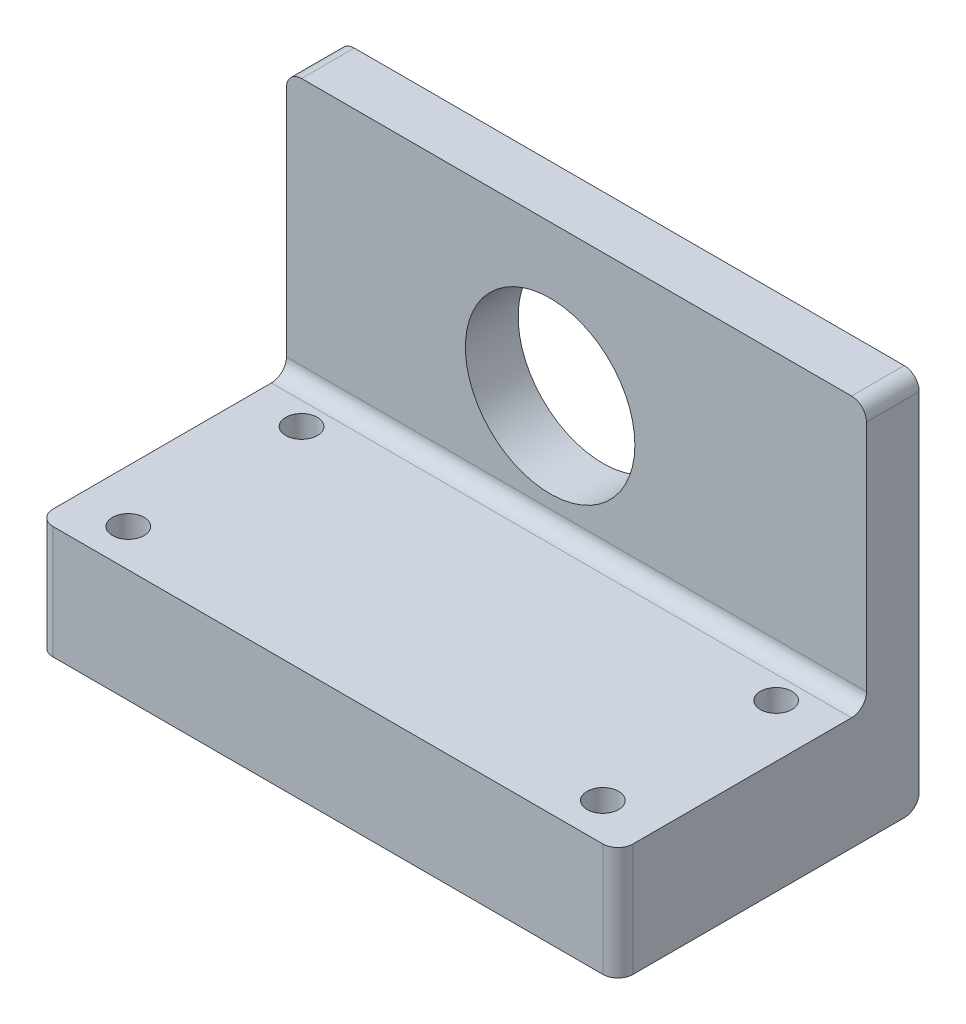
ISO-10303-21;
HEADER;
FILE_DESCRIPTION(('STEP AP214'),'2;1');
FILE_NAME('part.step','',(''),(''),'','','');
FILE_SCHEMA(('AUTOMOTIVE_DESIGN { 1 0 10303 214 1 1 1 1 }'));
ENDSEC;
DATA;
#1=APPLICATION_CONTEXT('core data for automotive mechanical design processes');
#2=APPLICATION_PROTOCOL_DEFINITION('international standard','automotive_design',2000,#1);
#3=PRODUCT_CONTEXT('',#1,'mechanical');
#4=PRODUCT('Part','Part','',(#3));
#5=PRODUCT_RELATED_PRODUCT_CATEGORY('part','',(#4));
#6=PRODUCT_DEFINITION_FORMATION('','',#4);
#7=PRODUCT_DEFINITION_CONTEXT('part definition',#1,'design');
#8=PRODUCT_DEFINITION('design','',#6,#7);
#9=PRODUCT_DEFINITION_SHAPE('','',#8);
#10=(LENGTH_UNIT() NAMED_UNIT(*) SI_UNIT(.MILLI.,.METRE.));
#11=(NAMED_UNIT(*) PLANE_ANGLE_UNIT() SI_UNIT($,.RADIAN.));
#12=(NAMED_UNIT(*) SI_UNIT($,.STERADIAN.) SOLID_ANGLE_UNIT());
#13=UNCERTAINTY_MEASURE_WITH_UNIT(LENGTH_MEASURE(1.E-05),#10,'distance_accuracy_value','');
#14=(GEOMETRIC_REPRESENTATION_CONTEXT(3) GLOBAL_UNCERTAINTY_ASSIGNED_CONTEXT((#13)) GLOBAL_UNIT_ASSIGNED_CONTEXT((#10,
#11,#12)) REPRESENTATION_CONTEXT('',''));
#15=CARTESIAN_POINT('',(0.,0.,0.));
#16=DIRECTION('',(0.,0.,1.));
#17=DIRECTION('',(1.,0.,0.));
#18=AXIS2_PLACEMENT_3D('',#15,#16,#17);
#19=CARTESIAN_POINT('',(-35.,17.5,7.));
#20=DIRECTION('',(1.,0.,0.));
#21=DIRECTION('',(0.,1.,0.));
#22=AXIS2_PLACEMENT_3D('',#19,#20,#21);
#23=PLANE('',#22);
#24=DIRECTION('',(0.,-1.,0.));
#25=VECTOR('',#24,1.);
#26=CARTESIAN_POINT('',(-35.,17.5,0.));
#27=LINE('',#26,#25);
#28=CARTESIAN_POINT('',(-35.,15.5,0.));
#29=VERTEX_POINT('',#28);
#30=CARTESIAN_POINT('',(-35.,-30.5,0.));
#31=VERTEX_POINT('',#30);
#32=EDGE_CURVE('E204',#29,#31,#27,.T.);
#33=ORIENTED_EDGE('',*,*,#32,.T.);
#34=CARTESIAN_POINT('',(-35.,-30.5,2.));
#35=DIRECTION('',(1.,0.,0.));
#36=DIRECTION('',(0.,1.,0.));
#37=AXIS2_PLACEMENT_3D('',#34,#35,#36);
#38=CIRCLE('',#37,2.);
#39=CARTESIAN_POINT('',(-35.,-32.5,2.));
#40=VERTEX_POINT('',#39);
#41=EDGE_CURVE('E167',#31,#40,#38,.F.);
#42=ORIENTED_EDGE('',*,*,#41,.T.);
#43=DIRECTION('',(0.,0.,-1.));
#44=VECTOR('',#43,1.);
#45=CARTESIAN_POINT('',(-35.,-32.5,40.));
#46=LINE('',#45,#44);
#47=CARTESIAN_POINT('',(-35.,-32.5,38.));
#48=VERTEX_POINT('',#47);
#49=EDGE_CURVE('E241',#48,#40,#46,.T.);
#50=ORIENTED_EDGE('',*,*,#49,.F.);
#51=DIRECTION('',(0.,1.,0.));
#52=VECTOR('',#51,1.);
#53=CARTESIAN_POINT('',(-35.,17.5,38.));
#54=LINE('',#53,#52);
#55=CARTESIAN_POINT('',(-35.,-17.5,38.));
#56=VERTEX_POINT('',#55);
#57=EDGE_CURVE('E165',#48,#56,#54,.T.);
#58=ORIENTED_EDGE('',*,*,#57,.T.);
#59=DIRECTION('',(0.,0.,-1.));
#60=VECTOR('',#59,1.);
#61=CARTESIAN_POINT('',(-35.,-17.5,40.));
#62=LINE('',#61,#60);
#63=CARTESIAN_POINT('',(-35.,-17.5,9.));
#64=VERTEX_POINT('',#63);
#65=EDGE_CURVE('E138',#56,#64,#62,.T.);
#66=ORIENTED_EDGE('',*,*,#65,.T.);
#67=CARTESIAN_POINT('',(-35.,-15.5,9.));
#68=DIRECTION('',(1.,0.,0.));
#69=DIRECTION('',(0.,1.,0.));
#70=AXIS2_PLACEMENT_3D('',#67,#68,#69);
#71=CIRCLE('',#70,2.);
#72=CARTESIAN_POINT('',(-35.,-15.5,7.));
#73=VERTEX_POINT('',#72);
#74=EDGE_CURVE('E134',#64,#73,#71,.T.);
#75=ORIENTED_EDGE('',*,*,#74,.T.);
#76=DIRECTION('',(0.,-1.,0.));
#77=VECTOR('',#76,1.);
#78=CARTESIAN_POINT('',(-35.,17.5,7.));
#79=LINE('',#78,#77);
#80=CARTESIAN_POINT('',(-35.,15.5,7.));
#81=VERTEX_POINT('',#80);
#82=EDGE_CURVE('E120',#81,#73,#79,.T.);
#83=ORIENTED_EDGE('',*,*,#82,.F.);
#84=DIRECTION('',(0.,0.,-1.));
#85=VECTOR('',#84,1.);
#86=CARTESIAN_POINT('',(-35.,15.5,7.));
#87=LINE('',#86,#85);
#88=EDGE_CURVE('E163',#81,#29,#87,.T.);
#89=ORIENTED_EDGE('',*,*,#88,.T.);
#90=EDGE_LOOP('',(#33,#42,#50,#58,#66,#75,#83,#89));
#91=FACE_BOUND('',#90,.T.);
#92=ADVANCED_FACE('F32',(#91),#23,.F.);
#93=CARTESIAN_POINT('',(42.,17.5,7.));
#94=DIRECTION('',(-1.,0.,0.));
#95=DIRECTION('',(0.,-1.,0.));
#96=AXIS2_PLACEMENT_3D('',#93,#94,#95);
#97=PLANE('',#96);
#98=DIRECTION('',(0.,0.,-1.));
#99=VECTOR('',#98,1.);
#100=CARTESIAN_POINT('',(42.,-32.5,40.));
#101=LINE('',#100,#99);
#102=CARTESIAN_POINT('',(42.,-32.5,38.));
#103=VERTEX_POINT('',#102);
#104=CARTESIAN_POINT('',(42.,-32.5,2.));
#105=VERTEX_POINT('',#104);
#106=EDGE_CURVE('E233',#103,#105,#101,.T.);
#107=ORIENTED_EDGE('',*,*,#106,.T.);
#108=CARTESIAN_POINT('',(42.,-30.5,2.));
#109=DIRECTION('',(-1.,0.,0.));
#110=DIRECTION('',(0.,-1.,0.));
#111=AXIS2_PLACEMENT_3D('',#108,#109,#110);
#112=CIRCLE('',#111,2.);
#113=CARTESIAN_POINT('',(42.,-30.5,0.));
#114=VERTEX_POINT('',#113);
#115=EDGE_CURVE('E180',#105,#114,#112,.F.);
#116=ORIENTED_EDGE('',*,*,#115,.T.);
#117=DIRECTION('',(0.,1.,0.));
#118=VECTOR('',#117,1.);
#119=CARTESIAN_POINT('',(42.,17.5,0.));
#120=LINE('',#119,#118);
#121=CARTESIAN_POINT('',(42.,15.5,0.));
#122=VERTEX_POINT('',#121);
#123=EDGE_CURVE('E202',#114,#122,#120,.T.);
#124=ORIENTED_EDGE('',*,*,#123,.T.);
#125=DIRECTION('',(0.,0.,-1.));
#126=VECTOR('',#125,1.);
#127=CARTESIAN_POINT('',(42.,15.5,7.));
#128=LINE('',#127,#126);
#129=CARTESIAN_POINT('',(42.,15.5,7.));
#130=VERTEX_POINT('',#129);
#131=EDGE_CURVE('E175',#122,#130,#128,.F.);
#132=ORIENTED_EDGE('',*,*,#131,.T.);
#133=DIRECTION('',(0.,1.,0.));
#134=VECTOR('',#133,1.);
#135=CARTESIAN_POINT('',(42.,17.5,7.));
#136=LINE('',#135,#134);
#137=CARTESIAN_POINT('',(42.,-15.5,7.));
#138=VERTEX_POINT('',#137);
#139=EDGE_CURVE('E130',#138,#130,#136,.T.);
#140=ORIENTED_EDGE('',*,*,#139,.F.);
#141=CARTESIAN_POINT('',(42.,-15.5,9.));
#142=DIRECTION('',(-1.,0.,0.));
#143=DIRECTION('',(0.,-1.,0.));
#144=AXIS2_PLACEMENT_3D('',#141,#142,#143);
#145=CIRCLE('',#144,2.);
#146=CARTESIAN_POINT('',(42.,-17.5,9.));
#147=VERTEX_POINT('',#146);
#148=EDGE_CURVE('E143',#138,#147,#145,.T.);
#149=ORIENTED_EDGE('',*,*,#148,.T.);
#150=DIRECTION('',(0.,0.,-1.));
#151=VECTOR('',#150,1.);
#152=CARTESIAN_POINT('',(42.,-17.5,40.));
#153=LINE('',#152,#151);
#154=CARTESIAN_POINT('',(42.,-17.5,38.));
#155=VERTEX_POINT('',#154);
#156=EDGE_CURVE('E238',#155,#147,#153,.T.);
#157=ORIENTED_EDGE('',*,*,#156,.F.);
#158=DIRECTION('',(0.,-1.,0.));
#159=VECTOR('',#158,1.);
#160=CARTESIAN_POINT('',(42.,17.5,38.));
#161=LINE('',#160,#159);
#162=EDGE_CURVE('E177',#155,#103,#161,.T.);
#163=ORIENTED_EDGE('',*,*,#162,.T.);
#164=EDGE_LOOP('',(#107,#116,#124,#132,#140,#149,#157,#163));
#165=FACE_BOUND('',#164,.T.);
#166=ADVANCED_FACE('F257',(#165),#97,.F.);
#167=CARTESIAN_POINT('',(-35.,17.5,7.));
#168=DIRECTION('',(0.,-1.,0.));
#169=DIRECTION('',(0.,0.,-1.));
#170=AXIS2_PLACEMENT_3D('',#167,#168,#169);
#171=PLANE('',#170);
#172=DIRECTION('',(-1.,0.,0.));
#173=VECTOR('',#172,1.);
#174=CARTESIAN_POINT('',(-35.,17.5,0.));
#175=LINE('',#174,#173);
#176=CARTESIAN_POINT('',(40.,17.5,0.));
#177=VERTEX_POINT('',#176);
#178=CARTESIAN_POINT('',(-33.,17.5,0.));
#179=VERTEX_POINT('',#178);
#180=EDGE_CURVE('E131',#177,#179,#175,.T.);
#181=ORIENTED_EDGE('',*,*,#180,.T.);
#182=DIRECTION('',(0.,0.,-1.));
#183=VECTOR('',#182,1.);
#184=CARTESIAN_POINT('',(-33.,17.5,7.));
#185=LINE('',#184,#183);
#186=CARTESIAN_POINT('',(-33.,17.5,7.));
#187=VERTEX_POINT('',#186);
#188=EDGE_CURVE('E47',#179,#187,#185,.F.);
#189=ORIENTED_EDGE('',*,*,#188,.T.);
#190=DIRECTION('',(-1.,0.,0.));
#191=VECTOR('',#190,1.);
#192=CARTESIAN_POINT('',(-35.,17.5,7.));
#193=LINE('',#192,#191);
#194=CARTESIAN_POINT('',(40.,17.5,7.));
#195=VERTEX_POINT('',#194);
#196=EDGE_CURVE('E148',#195,#187,#193,.T.);
#197=ORIENTED_EDGE('',*,*,#196,.F.);
#198=DIRECTION('',(0.,0.,-1.));
#199=VECTOR('',#198,1.);
#200=CARTESIAN_POINT('',(40.,17.5,7.));
#201=LINE('',#200,#199);
#202=EDGE_CURVE('E190',#195,#177,#201,.T.);
#203=ORIENTED_EDGE('',*,*,#202,.T.);
#204=EDGE_LOOP('',(#181,#189,#197,#203));
#205=FACE_BOUND('',#204,.T.);
#206=ADVANCED_FACE('F195',(#205),#171,.F.);
#207=CARTESIAN_POINT('',(0.,0.,7.));
#208=DIRECTION('',(0.,0.,1.));
#209=DIRECTION('',(1.,0.,0.));
#210=AXIS2_PLACEMENT_3D('',#207,#208,#209);
#211=PLANE('',#210);
#212=CARTESIAN_POINT('',(0.,-2.5,7.));
#213=DIRECTION('',(0.,0.,1.));
#214=DIRECTION('',(1.,0.,0.));
#215=AXIS2_PLACEMENT_3D('',#212,#213,#214);
#216=CIRCLE('',#215,11.25);
#217=CARTESIAN_POINT('',(11.25,-2.5,7.));
#218=VERTEX_POINT('',#217);
#219=EDGE_CURVE('E211',#218,#218,#216,.T.);
#220=ORIENTED_EDGE('',*,*,#219,.F.);
#221=EDGE_LOOP('',(#220));
#222=FACE_BOUND('',#221,.T.);
#223=ORIENTED_EDGE('',*,*,#196,.T.);
#224=CARTESIAN_POINT('',(-33.,15.5,7.));
#225=DIRECTION('',(0.,0.,1.));
#226=DIRECTION('',(1.,0.,0.));
#227=AXIS2_PLACEMENT_3D('',#224,#225,#226);
#228=CIRCLE('',#227,2.);
#229=EDGE_CURVE('E11',#187,#81,#228,.T.);
#230=ORIENTED_EDGE('',*,*,#229,.T.);
#231=ORIENTED_EDGE('',*,*,#82,.T.);
#232=DIRECTION('',(1.,0.,0.));
#233=VECTOR('',#232,1.);
#234=CARTESIAN_POINT('',(42.,-15.5,7.));
#235=LINE('',#234,#233);
#236=EDGE_CURVE('E124',#73,#138,#235,.T.);
#237=ORIENTED_EDGE('',*,*,#236,.T.);
#238=ORIENTED_EDGE('',*,*,#139,.T.);
#239=CARTESIAN_POINT('',(40.,15.5,7.));
#240=DIRECTION('',(0.,0.,1.));
#241=DIRECTION('',(1.,0.,0.));
#242=AXIS2_PLACEMENT_3D('',#239,#240,#241);
#243=CIRCLE('',#242,2.);
#244=EDGE_CURVE('E40',#130,#195,#243,.T.);
#245=ORIENTED_EDGE('',*,*,#244,.T.);
#246=EDGE_LOOP('',(#223,#230,#231,#237,#238,#245));
#247=FACE_BOUND('',#246,.T.);
#248=ADVANCED_FACE('F122',(#222,#247),#211,.T.);
#249=CARTESIAN_POINT('',(0.,0.,0.));
#250=DIRECTION('',(0.,0.,1.));
#251=DIRECTION('',(1.,0.,0.));
#252=AXIS2_PLACEMENT_3D('',#249,#250,#251);
#253=PLANE('',#252);
#254=CARTESIAN_POINT('',(0.,-2.5,0.));
#255=DIRECTION('',(0.,0.,1.));
#256=DIRECTION('',(1.,0.,0.));
#257=AXIS2_PLACEMENT_3D('',#254,#255,#256);
#258=CIRCLE('',#257,11.25);
#259=CARTESIAN_POINT('',(11.25,-2.5,0.));
#260=VERTEX_POINT('',#259);
#261=EDGE_CURVE('E208',#260,#260,#258,.T.);
#262=ORIENTED_EDGE('',*,*,#261,.T.);
#263=EDGE_LOOP('',(#262));
#264=FACE_BOUND('',#263,.T.);
#265=ORIENTED_EDGE('',*,*,#123,.F.);
#266=DIRECTION('',(-1.,0.,0.));
#267=VECTOR('',#266,1.);
#268=CARTESIAN_POINT('',(-35.,-30.5,0.));
#269=LINE('',#268,#267);
#270=EDGE_CURVE('E160',#114,#31,#269,.T.);
#271=ORIENTED_EDGE('',*,*,#270,.T.);
#272=ORIENTED_EDGE('',*,*,#32,.F.);
#273=CARTESIAN_POINT('',(-33.,15.5,0.));
#274=DIRECTION('',(0.,0.,1.));
#275=DIRECTION('',(1.,0.,0.));
#276=AXIS2_PLACEMENT_3D('',#273,#274,#275);
#277=CIRCLE('',#276,2.);
#278=EDGE_CURVE('E158',#29,#179,#277,.F.);
#279=ORIENTED_EDGE('',*,*,#278,.T.);
#280=ORIENTED_EDGE('',*,*,#180,.F.);
#281=CARTESIAN_POINT('',(40.,15.5,0.));
#282=DIRECTION('',(0.,0.,1.));
#283=DIRECTION('',(1.,0.,0.));
#284=AXIS2_PLACEMENT_3D('',#281,#282,#283);
#285=CIRCLE('',#284,2.);
#286=EDGE_CURVE('E142',#177,#122,#285,.F.);
#287=ORIENTED_EDGE('',*,*,#286,.T.);
#288=EDGE_LOOP('',(#265,#271,#272,#279,#280,#287));
#289=FACE_BOUND('',#288,.T.);
#290=ADVANCED_FACE('F199',(#264,#289),#253,.F.);
#291=CARTESIAN_POINT('',(0.,-2.5,-8.));
#292=DIRECTION('',(0.,0.,1.));
#293=DIRECTION('',(1.,0.,0.));
#294=AXIS2_PLACEMENT_3D('',#291,#292,#293);
#295=CYLINDRICAL_SURFACE('',#294,11.25);
#296=ORIENTED_EDGE('',*,*,#219,.T.);
#297=EDGE_LOOP('',(#296));
#298=FACE_BOUND('',#297,.T.);
#299=ORIENTED_EDGE('',*,*,#261,.F.);
#300=EDGE_LOOP('',(#299));
#301=FACE_BOUND('',#300,.T.);
#302=ADVANCED_FACE('F383',(#298,#301),#295,.F.);
#303=CARTESIAN_POINT('',(42.,-17.5,40.));
#304=DIRECTION('',(0.,1.,0.));
#305=DIRECTION('',(0.,0.,1.));
#306=AXIS2_PLACEMENT_3D('',#303,#304,#305);
#307=PLANE('',#306);
#308=CARTESIAN_POINT('',(-28.,-17.5,12.));
#309=DIRECTION('',(0.,1.,0.));
#310=DIRECTION('',(-1.,0.,0.));
#311=AXIS2_PLACEMENT_3D('',#308,#309,#310);
#312=CIRCLE('',#311,2.1);
#313=CARTESIAN_POINT('',(-30.1,-17.5,12.));
#314=VERTEX_POINT('',#313);
#315=EDGE_CURVE('E447',#314,#314,#312,.T.);
#316=ORIENTED_EDGE('',*,*,#315,.F.);
#317=EDGE_LOOP('',(#316));
#318=FACE_BOUND('',#317,.T.);
#319=CARTESIAN_POINT('',(35.,-17.5,35.));
#320=DIRECTION('',(0.,1.,0.));
#321=DIRECTION('',(-1.,0.,0.));
#322=AXIS2_PLACEMENT_3D('',#319,#320,#321);
#323=CIRCLE('',#322,2.1);
#324=CARTESIAN_POINT('',(32.9,-17.5,35.));
#325=VERTEX_POINT('',#324);
#326=EDGE_CURVE('E451',#325,#325,#323,.T.);
#327=ORIENTED_EDGE('',*,*,#326,.F.);
#328=EDGE_LOOP('',(#327));
#329=FACE_BOUND('',#328,.T.);
#330=CARTESIAN_POINT('',(35.,-17.5,12.));
#331=DIRECTION('',(0.,1.,0.));
#332=DIRECTION('',(-1.,0.,0.));
#333=AXIS2_PLACEMENT_3D('',#330,#331,#332);
#334=CIRCLE('',#333,2.1);
#335=CARTESIAN_POINT('',(32.9,-17.5,12.));
#336=VERTEX_POINT('',#335);
#337=EDGE_CURVE('E455',#336,#336,#334,.T.);
#338=ORIENTED_EDGE('',*,*,#337,.F.);
#339=EDGE_LOOP('',(#338));
#340=FACE_BOUND('',#339,.T.);
#341=CARTESIAN_POINT('',(-28.,-17.5,35.));
#342=DIRECTION('',(0.,1.,0.));
#343=DIRECTION('',(-1.,0.,0.));
#344=AXIS2_PLACEMENT_3D('',#341,#342,#343);
#345=CIRCLE('',#344,2.1);
#346=CARTESIAN_POINT('',(-30.1,-17.5,35.));
#347=VERTEX_POINT('',#346);
#348=EDGE_CURVE('E216',#347,#347,#345,.T.);
#349=ORIENTED_EDGE('',*,*,#348,.F.);
#350=EDGE_LOOP('',(#349));
#351=FACE_BOUND('',#350,.T.);
#352=DIRECTION('',(1.,0.,0.));
#353=VECTOR('',#352,1.);
#354=CARTESIAN_POINT('',(42.,-17.5,40.));
#355=LINE('',#354,#353);
#356=CARTESIAN_POINT('',(-33.,-17.5,40.));
#357=VERTEX_POINT('',#356);
#358=CARTESIAN_POINT('',(40.,-17.5,40.));
#359=VERTEX_POINT('',#358);
#360=EDGE_CURVE('E227',#357,#359,#355,.T.);
#361=ORIENTED_EDGE('',*,*,#360,.T.);
#362=CARTESIAN_POINT('',(40.,-17.5,38.));
#363=DIRECTION('',(0.,1.,0.));
#364=DIRECTION('',(0.,0.,1.));
#365=AXIS2_PLACEMENT_3D('',#362,#363,#364);
#366=CIRCLE('',#365,2.);
#367=EDGE_CURVE('E188',#359,#155,#366,.T.);
#368=ORIENTED_EDGE('',*,*,#367,.T.);
#369=ORIENTED_EDGE('',*,*,#156,.T.);
#370=DIRECTION('',(1.,0.,0.));
#371=VECTOR('',#370,1.);
#372=CARTESIAN_POINT('',(-35.,-17.5,9.));
#373=LINE('',#372,#371);
#374=EDGE_CURVE('E147',#147,#64,#373,.F.);
#375=ORIENTED_EDGE('',*,*,#374,.T.);
#376=ORIENTED_EDGE('',*,*,#65,.F.);
#377=CARTESIAN_POINT('',(-33.,-17.5,38.));
#378=DIRECTION('',(0.,1.,0.));
#379=DIRECTION('',(0.,0.,1.));
#380=AXIS2_PLACEMENT_3D('',#377,#378,#379);
#381=CIRCLE('',#380,2.);
#382=EDGE_CURVE('E186',#56,#357,#381,.T.);
#383=ORIENTED_EDGE('',*,*,#382,.T.);
#384=EDGE_LOOP('',(#361,#368,#369,#375,#376,#383));
#385=FACE_BOUND('',#384,.T.);
#386=ADVANCED_FACE('F272',(#318,#329,#340,#351,#385),#307,.T.);
#387=CARTESIAN_POINT('',(42.,-32.5,40.));
#388=DIRECTION('',(0.,-1.,0.));
#389=DIRECTION('',(0.,0.,-1.));
#390=AXIS2_PLACEMENT_3D('',#387,#388,#389);
#391=PLANE('',#390);
#392=CARTESIAN_POINT('',(-28.,-32.5,12.));
#393=DIRECTION('',(0.,-1.,0.));
#394=DIRECTION('',(0.,0.,-1.));
#395=AXIS2_PLACEMENT_3D('',#392,#393,#394);
#396=CIRCLE('',#395,2.1);
#397=CARTESIAN_POINT('',(-28.,-32.5,9.9));
#398=VERTEX_POINT('',#397);
#399=EDGE_CURVE('E153',#398,#398,#396,.T.);
#400=ORIENTED_EDGE('',*,*,#399,.F.);
#401=EDGE_LOOP('',(#400));
#402=FACE_BOUND('',#401,.T.);
#403=CARTESIAN_POINT('',(35.,-32.5,35.));
#404=DIRECTION('',(0.,-1.,0.));
#405=DIRECTION('',(0.,0.,-1.));
#406=AXIS2_PLACEMENT_3D('',#403,#404,#405);
#407=CIRCLE('',#406,2.1);
#408=CARTESIAN_POINT('',(35.,-32.5,32.9));
#409=VERTEX_POINT('',#408);
#410=EDGE_CURVE('E218',#409,#409,#407,.T.);
#411=ORIENTED_EDGE('',*,*,#410,.F.);
#412=EDGE_LOOP('',(#411));
#413=FACE_BOUND('',#412,.T.);
#414=CARTESIAN_POINT('',(35.,-32.5,12.));
#415=DIRECTION('',(0.,-1.,0.));
#416=DIRECTION('',(0.,0.,-1.));
#417=AXIS2_PLACEMENT_3D('',#414,#415,#416);
#418=CIRCLE('',#417,2.1);
#419=CARTESIAN_POINT('',(35.,-32.5,9.9));
#420=VERTEX_POINT('',#419);
#421=EDGE_CURVE('E215',#420,#420,#418,.T.);
#422=ORIENTED_EDGE('',*,*,#421,.F.);
#423=EDGE_LOOP('',(#422));
#424=FACE_BOUND('',#423,.T.);
#425=CARTESIAN_POINT('',(-28.,-32.5,35.));
#426=DIRECTION('',(0.,-1.,0.));
#427=DIRECTION('',(0.,0.,-1.));
#428=AXIS2_PLACEMENT_3D('',#425,#426,#427);
#429=CIRCLE('',#428,2.1);
#430=CARTESIAN_POINT('',(-28.,-32.5,32.9));
#431=VERTEX_POINT('',#430);
#432=EDGE_CURVE('E212',#431,#431,#429,.T.);
#433=ORIENTED_EDGE('',*,*,#432,.F.);
#434=EDGE_LOOP('',(#433));
#435=FACE_BOUND('',#434,.T.);
#436=ORIENTED_EDGE('',*,*,#49,.T.);
#437=DIRECTION('',(-1.,0.,0.));
#438=VECTOR('',#437,1.);
#439=CARTESIAN_POINT('',(42.,-32.5,2.));
#440=LINE('',#439,#438);
#441=EDGE_CURVE('E173',#40,#105,#440,.F.);
#442=ORIENTED_EDGE('',*,*,#441,.T.);
#443=ORIENTED_EDGE('',*,*,#106,.F.);
#444=CARTESIAN_POINT('',(40.,-32.5,38.));
#445=DIRECTION('',(0.,-1.,0.));
#446=DIRECTION('',(0.,0.,-1.));
#447=AXIS2_PLACEMENT_3D('',#444,#445,#446);
#448=CIRCLE('',#447,2.);
#449=CARTESIAN_POINT('',(40.,-32.5,40.));
#450=VERTEX_POINT('',#449);
#451=EDGE_CURVE('E171',#103,#450,#448,.T.);
#452=ORIENTED_EDGE('',*,*,#451,.T.);
#453=DIRECTION('',(-1.,0.,0.));
#454=VECTOR('',#453,1.);
#455=CARTESIAN_POINT('',(42.,-32.5,40.));
#456=LINE('',#455,#454);
#457=CARTESIAN_POINT('',(-33.,-32.5,40.));
#458=VERTEX_POINT('',#457);
#459=EDGE_CURVE('E223',#450,#458,#456,.T.);
#460=ORIENTED_EDGE('',*,*,#459,.T.);
#461=CARTESIAN_POINT('',(-33.,-32.5,38.));
#462=DIRECTION('',(0.,-1.,0.));
#463=DIRECTION('',(0.,0.,-1.));
#464=AXIS2_PLACEMENT_3D('',#461,#462,#463);
#465=CIRCLE('',#464,2.);
#466=EDGE_CURVE('E169',#458,#48,#465,.T.);
#467=ORIENTED_EDGE('',*,*,#466,.T.);
#468=EDGE_LOOP('',(#436,#442,#443,#452,#460,#467));
#469=FACE_BOUND('',#468,.T.);
#470=ADVANCED_FACE('F255',(#402,#413,#424,#435,#469),#391,.T.);
#471=CARTESIAN_POINT('',(0.,0.,40.));
#472=DIRECTION('',(0.,0.,-1.));
#473=DIRECTION('',(-1.,0.,0.));
#474=AXIS2_PLACEMENT_3D('',#471,#472,#473);
#475=PLANE('',#474);
#476=ORIENTED_EDGE('',*,*,#459,.F.);
#477=DIRECTION('',(0.,-1.,0.));
#478=VECTOR('',#477,1.);
#479=CARTESIAN_POINT('',(40.,0.,40.));
#480=LINE('',#479,#478);
#481=EDGE_CURVE('E184',#450,#359,#480,.F.);
#482=ORIENTED_EDGE('',*,*,#481,.T.);
#483=ORIENTED_EDGE('',*,*,#360,.F.);
#484=DIRECTION('',(0.,1.,0.));
#485=VECTOR('',#484,1.);
#486=CARTESIAN_POINT('',(-33.,0.,40.));
#487=LINE('',#486,#485);
#488=EDGE_CURVE('E182',#357,#458,#487,.F.);
#489=ORIENTED_EDGE('',*,*,#488,.T.);
#490=EDGE_LOOP('',(#476,#482,#483,#489));
#491=FACE_BOUND('',#490,.T.);
#492=ADVANCED_FACE('F265',(#491),#475,.F.);
#493=CARTESIAN_POINT('',(-28.,-37.5,35.));
#494=DIRECTION('',(0.,1.,0.));
#495=DIRECTION('',(-1.,0.,0.));
#496=AXIS2_PLACEMENT_3D('',#493,#494,#495);
#497=CYLINDRICAL_SURFACE('',#496,2.1);
#498=ORIENTED_EDGE('',*,*,#432,.T.);
#499=EDGE_LOOP('',(#498));
#500=FACE_BOUND('',#499,.T.);
#501=ORIENTED_EDGE('',*,*,#348,.T.);
#502=EDGE_LOOP('',(#501));
#503=FACE_BOUND('',#502,.T.);
#504=ADVANCED_FACE('F351',(#500,#503),#497,.F.);
#505=CARTESIAN_POINT('',(35.,-37.5,12.));
#506=DIRECTION('',(0.,1.,0.));
#507=DIRECTION('',(-1.,0.,0.));
#508=AXIS2_PLACEMENT_3D('',#505,#506,#507);
#509=CYLINDRICAL_SURFACE('',#508,2.1);
#510=ORIENTED_EDGE('',*,*,#421,.T.);
#511=EDGE_LOOP('',(#510));
#512=FACE_BOUND('',#511,.T.);
#513=ORIENTED_EDGE('',*,*,#337,.T.);
#514=EDGE_LOOP('',(#513));
#515=FACE_BOUND('',#514,.T.);
#516=ADVANCED_FACE('F343',(#512,#515),#509,.F.);
#517=CARTESIAN_POINT('',(35.,-37.5,35.));
#518=DIRECTION('',(0.,1.,0.));
#519=DIRECTION('',(-1.,0.,0.));
#520=AXIS2_PLACEMENT_3D('',#517,#518,#519);
#521=CYLINDRICAL_SURFACE('',#520,2.1);
#522=ORIENTED_EDGE('',*,*,#410,.T.);
#523=EDGE_LOOP('',(#522));
#524=FACE_BOUND('',#523,.T.);
#525=ORIENTED_EDGE('',*,*,#326,.T.);
#526=EDGE_LOOP('',(#525));
#527=FACE_BOUND('',#526,.T.);
#528=ADVANCED_FACE('F335',(#524,#527),#521,.F.);
#529=CARTESIAN_POINT('',(-28.,-37.5,12.));
#530=DIRECTION('',(0.,1.,0.));
#531=DIRECTION('',(-1.,0.,0.));
#532=AXIS2_PLACEMENT_3D('',#529,#530,#531);
#533=CYLINDRICAL_SURFACE('',#532,2.1);
#534=ORIENTED_EDGE('',*,*,#399,.T.);
#535=EDGE_LOOP('',(#534));
#536=FACE_BOUND('',#535,.T.);
#537=ORIENTED_EDGE('',*,*,#315,.T.);
#538=EDGE_LOOP('',(#537));
#539=FACE_BOUND('',#538,.T.);
#540=ADVANCED_FACE('F291',(#536,#539),#533,.F.);
#541=CARTESIAN_POINT('',(0.,-15.5,9.));
#542=DIRECTION('',(-1.,0.,0.));
#543=DIRECTION('',(0.,0.,1.));
#544=AXIS2_PLACEMENT_3D('',#541,#542,#543);
#545=CYLINDRICAL_SURFACE('',#544,2.);
#546=ORIENTED_EDGE('',*,*,#74,.F.);
#547=ORIENTED_EDGE('',*,*,#374,.F.);
#548=ORIENTED_EDGE('',*,*,#148,.F.);
#549=ORIENTED_EDGE('',*,*,#236,.F.);
#550=EDGE_LOOP('',(#546,#547,#548,#549));
#551=FACE_BOUND('',#550,.T.);
#552=ADVANCED_FACE('F145',(#551),#545,.F.);
#553=CARTESIAN_POINT('',(0.,-30.5,2.));
#554=DIRECTION('',(1.,0.,0.));
#555=DIRECTION('',(0.,0.,-1.));
#556=AXIS2_PLACEMENT_3D('',#553,#554,#555);
#557=CYLINDRICAL_SURFACE('',#556,2.);
#558=ORIENTED_EDGE('',*,*,#115,.F.);
#559=ORIENTED_EDGE('',*,*,#441,.F.);
#560=ORIENTED_EDGE('',*,*,#41,.F.);
#561=ORIENTED_EDGE('',*,*,#270,.F.);
#562=EDGE_LOOP('',(#558,#559,#560,#561));
#563=FACE_BOUND('',#562,.T.);
#564=ADVANCED_FACE('F252',(#563),#557,.T.);
#565=CARTESIAN_POINT('',(40.,17.5,38.));
#566=DIRECTION('',(0.,-1.,0.));
#567=DIRECTION('',(1.,0.,0.));
#568=AXIS2_PLACEMENT_3D('',#565,#566,#567);
#569=CYLINDRICAL_SURFACE('',#568,2.);
#570=ORIENTED_EDGE('',*,*,#367,.F.);
#571=ORIENTED_EDGE('',*,*,#481,.F.);
#572=ORIENTED_EDGE('',*,*,#451,.F.);
#573=ORIENTED_EDGE('',*,*,#162,.F.);
#574=EDGE_LOOP('',(#570,#571,#572,#573));
#575=FACE_BOUND('',#574,.T.);
#576=ADVANCED_FACE('F262',(#575),#569,.T.);
#577=CARTESIAN_POINT('',(-33.,17.5,38.));
#578=DIRECTION('',(0.,1.,0.));
#579=DIRECTION('',(-1.,0.,0.));
#580=AXIS2_PLACEMENT_3D('',#577,#578,#579);
#581=CYLINDRICAL_SURFACE('',#580,2.);
#582=ORIENTED_EDGE('',*,*,#466,.F.);
#583=ORIENTED_EDGE('',*,*,#488,.F.);
#584=ORIENTED_EDGE('',*,*,#382,.F.);
#585=ORIENTED_EDGE('',*,*,#57,.F.);
#586=EDGE_LOOP('',(#582,#583,#584,#585));
#587=FACE_BOUND('',#586,.T.);
#588=ADVANCED_FACE('F269',(#587),#581,.T.);
#589=CARTESIAN_POINT('',(-33.,15.5,7.));
#590=DIRECTION('',(0.,0.,-1.));
#591=DIRECTION('',(-1.,0.,0.));
#592=AXIS2_PLACEMENT_3D('',#589,#590,#591);
#593=CYLINDRICAL_SURFACE('',#592,2.);
#594=ORIENTED_EDGE('',*,*,#229,.F.);
#595=ORIENTED_EDGE('',*,*,#188,.F.);
#596=ORIENTED_EDGE('',*,*,#278,.F.);
#597=ORIENTED_EDGE('',*,*,#88,.F.);
#598=EDGE_LOOP('',(#594,#595,#596,#597));
#599=FACE_BOUND('',#598,.T.);
#600=ADVANCED_FACE('F275',(#599),#593,.T.);
#601=CARTESIAN_POINT('',(40.,15.5,7.));
#602=DIRECTION('',(0.,0.,-1.));
#603=DIRECTION('',(-1.,0.,0.));
#604=AXIS2_PLACEMENT_3D('',#601,#602,#603);
#605=CYLINDRICAL_SURFACE('',#604,2.);
#606=ORIENTED_EDGE('',*,*,#244,.F.);
#607=ORIENTED_EDGE('',*,*,#131,.F.);
#608=ORIENTED_EDGE('',*,*,#286,.F.);
#609=ORIENTED_EDGE('',*,*,#202,.F.);
#610=EDGE_LOOP('',(#606,#607,#608,#609));
#611=FACE_BOUND('',#610,.T.);
#612=ADVANCED_FACE('F34',(#611),#605,.T.);
#613=CLOSED_SHELL('',(#92,#166,#206,#248,#290,#302,#386,#470,#492,#504,#516,#528,#540,#552,#564,
#576,#588,#600,#612));
#614=MANIFOLD_SOLID_BREP('B2',#613);
#615=ADVANCED_BREP_SHAPE_REPRESENTATION('',(#18,#614),#14);
#616=SHAPE_DEFINITION_REPRESENTATION(#9,#615);
ENDSEC;
END-ISO-10303-21;
